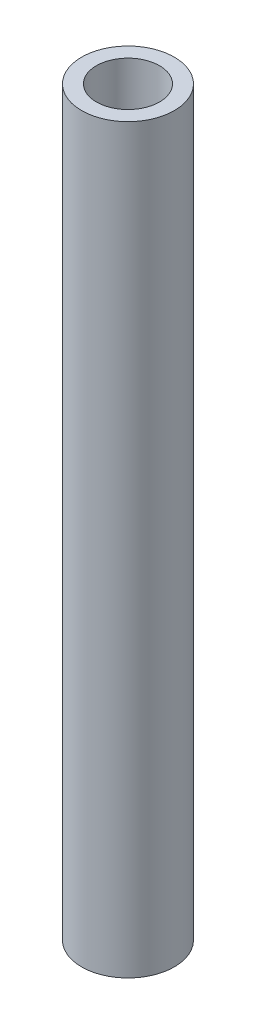
ISO-10303-21;
HEADER;
FILE_DESCRIPTION(('STEP AP214'),'2;1');
FILE_NAME('part.step','',(''),(''),'','','');
FILE_SCHEMA(('AUTOMOTIVE_DESIGN { 1 0 10303 214 1 1 1 1 }'));
ENDSEC;
DATA;
#1=APPLICATION_CONTEXT('core data for automotive mechanical design processes');
#2=APPLICATION_PROTOCOL_DEFINITION('international standard','automotive_design',2000,#1);
#3=PRODUCT_CONTEXT('',#1,'mechanical');
#4=PRODUCT('Part','Part','',(#3));
#5=PRODUCT_RELATED_PRODUCT_CATEGORY('part','',(#4));
#6=PRODUCT_DEFINITION_FORMATION('','',#4);
#7=PRODUCT_DEFINITION_CONTEXT('part definition',#1,'design');
#8=PRODUCT_DEFINITION('design','',#6,#7);
#9=PRODUCT_DEFINITION_SHAPE('','',#8);
#10=(LENGTH_UNIT() NAMED_UNIT(*) SI_UNIT(.MILLI.,.METRE.));
#11=(NAMED_UNIT(*) PLANE_ANGLE_UNIT() SI_UNIT($,.RADIAN.));
#12=(NAMED_UNIT(*) SI_UNIT($,.STERADIAN.) SOLID_ANGLE_UNIT());
#13=UNCERTAINTY_MEASURE_WITH_UNIT(LENGTH_MEASURE(1.E-05),#10,'distance_accuracy_value','');
#14=(GEOMETRIC_REPRESENTATION_CONTEXT(3) GLOBAL_UNCERTAINTY_ASSIGNED_CONTEXT((#13)) GLOBAL_UNIT_ASSIGNED_CONTEXT((#10,
#11,#12)) REPRESENTATION_CONTEXT('',''));
#15=CARTESIAN_POINT('',(0.,0.,0.));
#16=DIRECTION('',(0.,0.,1.));
#17=DIRECTION('',(1.,0.,0.));
#18=AXIS2_PLACEMENT_3D('',#15,#16,#17);
#19=CARTESIAN_POINT('',(0.,5.,0.));
#20=DIRECTION('',(0.,1.,0.));
#21=DIRECTION('',(0.,0.,1.));
#22=AXIS2_PLACEMENT_3D('',#19,#20,#21);
#23=PLANE('',#22);
#24=CARTESIAN_POINT('',(0.,5.,0.));
#25=DIRECTION('',(0.,1.,0.));
#26=DIRECTION('',(0.,0.,1.));
#27=AXIS2_PLACEMENT_3D('',#24,#25,#26);
#28=CIRCLE('',#27,0.3125);
#29=CARTESIAN_POINT('',(0.,5.,0.3125));
#30=VERTEX_POINT('',#29);
#31=EDGE_CURVE('E10',#30,#30,#28,.T.);
#32=ORIENTED_EDGE('',*,*,#31,.T.);
#33=EDGE_LOOP('',(#32));
#34=FACE_BOUND('',#33,.T.);
#35=CARTESIAN_POINT('',(0.,5.,0.));
#36=DIRECTION('',(0.,1.,0.));
#37=DIRECTION('',(0.,0.,1.));
#38=AXIS2_PLACEMENT_3D('',#35,#36,#37);
#39=CIRCLE('',#38,0.2125);
#40=CARTESIAN_POINT('',(0.,5.,0.2125));
#41=VERTEX_POINT('',#40);
#42=EDGE_CURVE('E42',#41,#41,#39,.T.);
#43=ORIENTED_EDGE('',*,*,#42,.F.);
#44=EDGE_LOOP('',(#43));
#45=FACE_BOUND('',#44,.T.);
#46=ADVANCED_FACE('F31',(#34,#45),#23,.T.);
#47=CARTESIAN_POINT('',(0.,0.,0.));
#48=DIRECTION('',(0.,1.,0.));
#49=DIRECTION('',(0.,0.,1.));
#50=AXIS2_PLACEMENT_3D('',#47,#48,#49);
#51=PLANE('',#50);
#52=CARTESIAN_POINT('',(0.,0.,0.));
#53=DIRECTION('',(0.,1.,0.));
#54=DIRECTION('',(0.,0.,1.));
#55=AXIS2_PLACEMENT_3D('',#52,#53,#54);
#56=CIRCLE('',#55,0.3125);
#57=CARTESIAN_POINT('',(0.,0.,0.3125));
#58=VERTEX_POINT('',#57);
#59=EDGE_CURVE('E35',#58,#58,#56,.T.);
#60=ORIENTED_EDGE('',*,*,#59,.F.);
#61=EDGE_LOOP('',(#60));
#62=FACE_BOUND('',#61,.T.);
#63=CARTESIAN_POINT('',(0.,0.,0.));
#64=DIRECTION('',(0.,1.,0.));
#65=DIRECTION('',(0.,0.,1.));
#66=AXIS2_PLACEMENT_3D('',#63,#64,#65);
#67=CIRCLE('',#66,0.2125);
#68=CARTESIAN_POINT('',(0.,0.,0.2125));
#69=VERTEX_POINT('',#68);
#70=EDGE_CURVE('E44',#69,#69,#67,.T.);
#71=ORIENTED_EDGE('',*,*,#70,.T.);
#72=EDGE_LOOP('',(#71));
#73=FACE_BOUND('',#72,.T.);
#74=ADVANCED_FACE('F54',(#62,#73),#51,.F.);
#75=CARTESIAN_POINT('',(0.,5.,0.));
#76=DIRECTION('',(0.,-1.,0.));
#77=DIRECTION('',(0.,0.,-1.));
#78=AXIS2_PLACEMENT_3D('',#75,#76,#77);
#79=CYLINDRICAL_SURFACE('',#78,0.3125);
#80=ORIENTED_EDGE('',*,*,#31,.F.);
#81=EDGE_LOOP('',(#80));
#82=FACE_BOUND('',#81,.T.);
#83=ORIENTED_EDGE('',*,*,#59,.T.);
#84=EDGE_LOOP('',(#83));
#85=FACE_BOUND('',#84,.T.);
#86=ADVANCED_FACE('F33',(#82,#85),#79,.T.);
#87=CARTESIAN_POINT('',(0.,5.,0.));
#88=DIRECTION('',(0.,-1.,0.));
#89=DIRECTION('',(0.,0.,-1.));
#90=AXIS2_PLACEMENT_3D('',#87,#88,#89);
#91=CYLINDRICAL_SURFACE('',#90,0.2125);
#92=ORIENTED_EDGE('',*,*,#42,.T.);
#93=EDGE_LOOP('',(#92));
#94=FACE_BOUND('',#93,.T.);
#95=ORIENTED_EDGE('',*,*,#70,.F.);
#96=EDGE_LOOP('',(#95));
#97=FACE_BOUND('',#96,.T.);
#98=ADVANCED_FACE('F50',(#94,#97),#91,.F.);
#99=CLOSED_SHELL('',(#46,#74,#86,#98));
#100=MANIFOLD_SOLID_BREP('B2',#99);
#101=ADVANCED_BREP_SHAPE_REPRESENTATION('',(#18,#100),#14);
#102=SHAPE_DEFINITION_REPRESENTATION(#9,#101);
ENDSEC;
END-ISO-10303-21;
